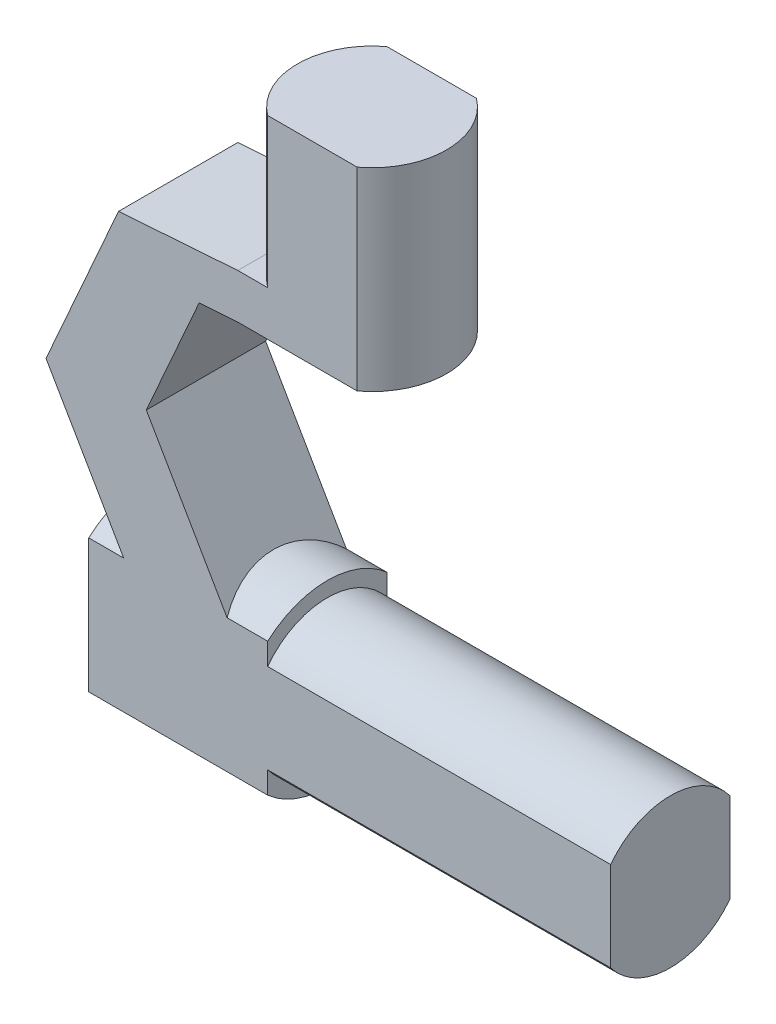
ISO-10303-21;
HEADER;
FILE_DESCRIPTION(('STEP AP214'),'2;1');
FILE_NAME('part.step','',(''),(''),'','','');
FILE_SCHEMA(('AUTOMOTIVE_DESIGN { 1 0 10303 214 1 1 1 1 }'));
ENDSEC;
DATA;
#1=APPLICATION_CONTEXT('core data for automotive mechanical design processes');
#2=APPLICATION_PROTOCOL_DEFINITION('international standard','automotive_design',2000,#1);
#3=PRODUCT_CONTEXT('',#1,'mechanical');
#4=PRODUCT('Part','Part','',(#3));
#5=PRODUCT_RELATED_PRODUCT_CATEGORY('part','',(#4));
#6=PRODUCT_DEFINITION_FORMATION('','',#4);
#7=PRODUCT_DEFINITION_CONTEXT('part definition',#1,'design');
#8=PRODUCT_DEFINITION('design','',#6,#7);
#9=PRODUCT_DEFINITION_SHAPE('','',#8);
#10=(LENGTH_UNIT() NAMED_UNIT(*) SI_UNIT(.MILLI.,.METRE.));
#11=(NAMED_UNIT(*) PLANE_ANGLE_UNIT() SI_UNIT($,.RADIAN.));
#12=(NAMED_UNIT(*) SI_UNIT($,.STERADIAN.) SOLID_ANGLE_UNIT());
#13=UNCERTAINTY_MEASURE_WITH_UNIT(LENGTH_MEASURE(1.E-05),#10,'distance_accuracy_value','');
#14=(GEOMETRIC_REPRESENTATION_CONTEXT(3) GLOBAL_UNCERTAINTY_ASSIGNED_CONTEXT((#13)) GLOBAL_UNIT_ASSIGNED_CONTEXT((#10,
#11,#12)) REPRESENTATION_CONTEXT('',''));
#15=CARTESIAN_POINT('',(0.,0.,0.));
#16=DIRECTION('',(0.,0.,1.));
#17=DIRECTION('',(1.,0.,0.));
#18=AXIS2_PLACEMENT_3D('',#15,#16,#17);
#19=CARTESIAN_POINT('',(0.,3.,0.));
#20=DIRECTION('',(0.,-1.,0.));
#21=DIRECTION('',(0.,0.,-1.));
#22=AXIS2_PLACEMENT_3D('',#19,#20,#21);
#23=CYLINDRICAL_SURFACE('',#22,5.);
#24=CARTESIAN_POINT('',(0.,13.,0.));
#25=DIRECTION('',(0.,1.,0.));
#26=DIRECTION('',(0.,0.,1.));
#27=AXIS2_PLACEMENT_3D('',#24,#25,#26);
#28=CIRCLE('',#27,5.);
#29=CARTESIAN_POINT('',(-3.00000000000001,13.,-3.99999999999999));
#30=VERTEX_POINT('',#29);
#31=CARTESIAN_POINT('',(-3.00000000000001,13.,3.99999999999999));
#32=VERTEX_POINT('',#31);
#33=EDGE_CURVE('E190',#30,#32,#28,.T.);
#34=ORIENTED_EDGE('',*,*,#33,.F.);
#35=DIRECTION('',(0.,-1.,0.));
#36=VECTOR('',#35,1.);
#37=CARTESIAN_POINT('',(-3.00000000000001,3.,-3.99999999999999));
#38=LINE('',#37,#36);
#39=CARTESIAN_POINT('',(-3.00000000000001,3.,-3.99999999999999));
#40=VERTEX_POINT('',#39);
#41=EDGE_CURVE('E54',#30,#40,#38,.T.);
#42=ORIENTED_EDGE('',*,*,#41,.T.);
#43=CARTESIAN_POINT('',(0.,3.,0.));
#44=DIRECTION('',(0.,1.,0.));
#45=DIRECTION('',(0.,0.,1.));
#46=AXIS2_PLACEMENT_3D('',#43,#44,#45);
#47=CIRCLE('',#46,5.);
#48=CARTESIAN_POINT('',(-5.,3.,0.));
#49=VERTEX_POINT('',#48);
#50=EDGE_CURVE('E197',#40,#49,#47,.T.);
#51=ORIENTED_EDGE('',*,*,#50,.T.);
#52=CARTESIAN_POINT('',(-3.,3.,3.99999999999999));
#53=VERTEX_POINT('',#52);
#54=EDGE_CURVE('E192',#49,#53,#47,.T.);
#55=ORIENTED_EDGE('',*,*,#54,.T.);
#56=DIRECTION('',(0.,-1.,0.));
#57=VECTOR('',#56,1.);
#58=CARTESIAN_POINT('',(-3.00000000000001,3.,3.99999999999999));
#59=LINE('',#58,#57);
#60=EDGE_CURVE('E179',#53,#32,#59,.F.);
#61=ORIENTED_EDGE('',*,*,#60,.T.);
#62=EDGE_LOOP('',(#34,#42,#51,#55,#61));
#63=FACE_BOUND('',#62,.T.);
#64=ADVANCED_FACE('F39',(#63),#23,.T.);
#65=CARTESIAN_POINT('',(-3.,-22.,0.));
#66=DIRECTION('',(-1.,0.,0.));
#67=DIRECTION('',(0.,0.,1.));
#68=AXIS2_PLACEMENT_3D('',#65,#66,#67);
#69=CYLINDRICAL_SURFACE('',#68,6.);
#70=DIRECTION('',(-1.,0.,0.));
#71=VECTOR('',#70,1.);
#72=CARTESIAN_POINT('',(-3.,-17.5278640450004,-3.99999999999999));
#73=LINE('',#72,#71);
#74=CARTESIAN_POINT('',(-15.,-17.5278640450004,-3.99999999999999));
#75=VERTEX_POINT('',#74);
#76=CARTESIAN_POINT('',(-12.6546913982316,-17.5278640450004,-3.99999999999999));
#77=VERTEX_POINT('',#76);
#78=EDGE_CURVE('E358',#75,#77,#73,.F.);
#79=ORIENTED_EDGE('',*,*,#78,.F.);
#80=CARTESIAN_POINT('',(-15.,-22.,0.));
#81=DIRECTION('',(-1.,0.,0.));
#82=DIRECTION('',(0.,0.,1.));
#83=AXIS2_PLACEMENT_3D('',#80,#81,#82);
#84=CIRCLE('',#83,6.);
#85=CARTESIAN_POINT('',(-15.,-17.5278640450004,3.99999999999999));
#86=VERTEX_POINT('',#85);
#87=EDGE_CURVE('E329',#86,#75,#84,.T.);
#88=ORIENTED_EDGE('',*,*,#87,.F.);
#89=DIRECTION('',(-1.,0.,0.));
#90=VECTOR('',#89,1.);
#91=CARTESIAN_POINT('',(-3.,-17.5278640450004,3.99999999999999));
#92=LINE('',#91,#90);
#93=CARTESIAN_POINT('',(-12.6546913982316,-17.5278640450004,3.99999999999999));
#94=VERTEX_POINT('',#93);
#95=EDGE_CURVE('E303',#94,#86,#92,.T.);
#96=ORIENTED_EDGE('',*,*,#95,.F.);
#97=CARTESIAN_POINT('',(-10.0638089663825,-22.,0.));
#98=DIRECTION('',(0.865279339103613,0.501290001217274,0.));
#99=DIRECTION('',(-0.501290001217274,0.865279339103613,0.));
#100=AXIS2_PLACEMENT_3D('',#97,#98,#99);
#101=ELLIPSE('',#100,6.93417689392157,6.);
#102=EDGE_CURVE('E200',#77,#94,#101,.T.);
#103=ORIENTED_EDGE('',*,*,#102,.F.);
#104=EDGE_LOOP('',(#79,#88,#96,#103));
#105=FACE_BOUND('',#104,.T.);
#106=ADVANCED_FACE('F355',(#105),#69,.T.);
#107=CARTESIAN_POINT('',(-5.72051450430999,-17.5278640450004,-3.99999999999999));
#108=VERTEX_POINT('',#107);
#109=CARTESIAN_POINT('',(-3.,-17.5278640450004,-3.99999999999999));
#110=VERTEX_POINT('',#109);
#111=EDGE_CURVE('E360',#108,#110,#73,.F.);
#112=ORIENTED_EDGE('',*,*,#111,.F.);
#113=CARTESIAN_POINT('',(-3.12963207246089,-22.,0.));
#114=DIRECTION('',(-0.865279339103613,-0.501290001217274,0.));
#115=DIRECTION('',(-0.501290001217274,0.865279339103613,0.));
#116=AXIS2_PLACEMENT_3D('',#113,#114,#115);
#117=ELLIPSE('',#116,6.93417689392157,6.);
#118=CARTESIAN_POINT('',(-5.72051450430999,-17.5278640450004,3.99999999999999));
#119=VERTEX_POINT('',#118);
#120=EDGE_CURVE('E269',#119,#108,#117,.T.);
#121=ORIENTED_EDGE('',*,*,#120,.F.);
#122=CARTESIAN_POINT('',(-3.,-17.5278640450004,3.99999999999999));
#123=VERTEX_POINT('',#122);
#124=EDGE_CURVE('E307',#123,#119,#92,.T.);
#125=ORIENTED_EDGE('',*,*,#124,.F.);
#126=CARTESIAN_POINT('',(-3.,-22.,0.));
#127=DIRECTION('',(-1.,0.,0.));
#128=DIRECTION('',(0.,0.,1.));
#129=AXIS2_PLACEMENT_3D('',#126,#127,#128);
#130=CIRCLE('',#129,6.);
#131=EDGE_CURVE('E302',#123,#110,#130,.T.);
#132=ORIENTED_EDGE('',*,*,#131,.T.);
#133=EDGE_LOOP('',(#112,#121,#125,#132));
#134=FACE_BOUND('',#133,.T.);
#135=ADVANCED_FACE('F368',(#134),#69,.T.);
#136=CARTESIAN_POINT('',(-3.,-22.,0.));
#137=DIRECTION('',(-1.,0.,0.));
#138=DIRECTION('',(0.,0.,1.));
#139=AXIS2_PLACEMENT_3D('',#136,#137,#138);
#140=PLANE('',#139);
#141=CARTESIAN_POINT('',(-3.,-26.4721359549996,-3.99999999999999));
#142=VERTEX_POINT('',#141);
#143=CARTESIAN_POINT('',(-3.,-26.4721359549996,3.99999999999999));
#144=VERTEX_POINT('',#143);
#145=EDGE_CURVE('E334',#142,#144,#130,.T.);
#146=ORIENTED_EDGE('',*,*,#145,.F.);
#147=DIRECTION('',(0.,1.,0.));
#148=VECTOR('',#147,1.);
#149=CARTESIAN_POINT('',(-3.,-22.,-3.99999999999999));
#150=LINE('',#149,#148);
#151=CARTESIAN_POINT('',(-3.,-25.,-3.99999999999999));
#152=VERTEX_POINT('',#151);
#153=EDGE_CURVE('E346',#142,#152,#150,.T.);
#154=ORIENTED_EDGE('',*,*,#153,.T.);
#155=CARTESIAN_POINT('',(-3.,-22.,0.));
#156=DIRECTION('',(-1.,0.,0.));
#157=DIRECTION('',(0.,0.,1.));
#158=AXIS2_PLACEMENT_3D('',#155,#156,#157);
#159=CIRCLE('',#158,5.);
#160=CARTESIAN_POINT('',(-3.,-25.,3.99999999999999));
#161=VERTEX_POINT('',#160);
#162=EDGE_CURVE('E265',#161,#152,#159,.F.);
#163=ORIENTED_EDGE('',*,*,#162,.F.);
#164=DIRECTION('',(0.,-1.,0.));
#165=VECTOR('',#164,1.);
#166=CARTESIAN_POINT('',(-3.,-22.,3.99999999999999));
#167=LINE('',#166,#165);
#168=EDGE_CURVE('E306',#161,#144,#167,.T.);
#169=ORIENTED_EDGE('',*,*,#168,.T.);
#170=EDGE_LOOP('',(#146,#154,#163,#169));
#171=FACE_BOUND('',#170,.T.);
#172=ADVANCED_FACE('F345',(#171),#140,.F.);
#173=CARTESIAN_POINT('',(-15.,-22.,0.));
#174=DIRECTION('',(1.,0.,0.));
#175=DIRECTION('',(0.,0.,-1.));
#176=AXIS2_PLACEMENT_3D('',#173,#174,#175);
#177=CYLINDRICAL_SURFACE('',#176,5.);
#178=DIRECTION('',(1.,0.,0.));
#179=VECTOR('',#178,1.);
#180=CARTESIAN_POINT('',(-15.,-25.,-3.99999999999999));
#181=LINE('',#180,#179);
#182=CARTESIAN_POINT('',(20.,-25.,-4.));
#183=VERTEX_POINT('',#182);
#184=EDGE_CURVE('E11',#183,#152,#181,.F.);
#185=ORIENTED_EDGE('',*,*,#184,.F.);
#186=CARTESIAN_POINT('',(20.,-22.,0.));
#187=DIRECTION('',(1.,0.,0.));
#188=DIRECTION('',(0.,0.,-1.));
#189=AXIS2_PLACEMENT_3D('',#186,#187,#188);
#190=CIRCLE('',#189,5.);
#191=CARTESIAN_POINT('',(20.,-25.,3.99999999999999));
#192=VERTEX_POINT('',#191);
#193=EDGE_CURVE('E199',#192,#183,#190,.T.);
#194=ORIENTED_EDGE('',*,*,#193,.F.);
#195=DIRECTION('',(1.,0.,0.));
#196=VECTOR('',#195,1.);
#197=CARTESIAN_POINT('',(-15.,-25.,3.99999999999999));
#198=LINE('',#197,#196);
#199=EDGE_CURVE('E272',#161,#192,#198,.T.);
#200=ORIENTED_EDGE('',*,*,#199,.F.);
#201=ORIENTED_EDGE('',*,*,#162,.T.);
#202=EDGE_LOOP('',(#185,#194,#200,#201));
#203=FACE_BOUND('',#202,.T.);
#204=ADVANCED_FACE('F351',(#203),#177,.T.);
#205=CARTESIAN_POINT('',(0.,3.,0.));
#206=DIRECTION('',(0.,1.,0.));
#207=DIRECTION('',(0.,0.,1.));
#208=AXIS2_PLACEMENT_3D('',#205,#206,#207);
#209=PLANE('',#208);
#210=ORIENTED_EDGE('',*,*,#50,.F.);
#211=DIRECTION('',(-1.,0.,0.));
#212=VECTOR('',#211,1.);
#213=CARTESIAN_POINT('',(0.,3.,-4.));
#214=LINE('',#213,#212);
#215=CARTESIAN_POINT('',(-5.,3.,-4.));
#216=VERTEX_POINT('',#215);
#217=EDGE_CURVE('E208',#40,#216,#214,.T.);
#218=ORIENTED_EDGE('',*,*,#217,.T.);
#219=DIRECTION('',(0.,0.,-1.));
#220=VECTOR('',#219,1.);
#221=CARTESIAN_POINT('',(-5.,3.,4.));
#222=LINE('',#221,#220);
#223=EDGE_CURVE('E258',#49,#216,#222,.T.);
#224=ORIENTED_EDGE('',*,*,#223,.F.);
#225=EDGE_LOOP('',(#210,#218,#224));
#226=FACE_BOUND('',#225,.T.);
#227=ADVANCED_FACE('F400',(#226),#209,.T.);
#228=CARTESIAN_POINT('',(0.,0.,0.));
#229=DIRECTION('',(0.,1.,0.));
#230=DIRECTION('',(0.,0.,1.));
#231=AXIS2_PLACEMENT_3D('',#228,#229,#230);
#232=CIRCLE('',#231,5.);
#233=CARTESIAN_POINT('',(3.00000000000001,0.,4.));
#234=VERTEX_POINT('',#233);
#235=CARTESIAN_POINT('',(3.00000000000001,0.,-4.));
#236=VERTEX_POINT('',#235);
#237=EDGE_CURVE('E262',#234,#236,#232,.T.);
#238=ORIENTED_EDGE('',*,*,#237,.T.);
#239=DIRECTION('',(0.,-1.,0.));
#240=VECTOR('',#239,1.);
#241=CARTESIAN_POINT('',(3.00000000000001,3.,-3.99999999999999));
#242=LINE('',#241,#240);
#243=CARTESIAN_POINT('',(3.00000000000001,13.,-4.));
#244=VERTEX_POINT('',#243);
#245=EDGE_CURVE('E323',#236,#244,#242,.F.);
#246=ORIENTED_EDGE('',*,*,#245,.T.);
#247=CARTESIAN_POINT('',(3.00000000000001,13.,4.));
#248=VERTEX_POINT('',#247);
#249=EDGE_CURVE('E196',#248,#244,#28,.T.);
#250=ORIENTED_EDGE('',*,*,#249,.F.);
#251=DIRECTION('',(0.,-1.,0.));
#252=VECTOR('',#251,1.);
#253=CARTESIAN_POINT('',(3.00000000000001,3.,3.99999999999999));
#254=LINE('',#253,#252);
#255=EDGE_CURVE('E62',#248,#234,#254,.T.);
#256=ORIENTED_EDGE('',*,*,#255,.T.);
#257=EDGE_LOOP('',(#238,#246,#250,#256));
#258=FACE_BOUND('',#257,.T.);
#259=ADVANCED_FACE('F41',(#258),#23,.T.);
#260=ORIENTED_EDGE('',*,*,#54,.F.);
#261=CARTESIAN_POINT('',(-5.,3.,4.));
#262=VERTEX_POINT('',#261);
#263=EDGE_CURVE('E259',#262,#49,#222,.T.);
#264=ORIENTED_EDGE('',*,*,#263,.F.);
#265=DIRECTION('',(-1.,0.,0.));
#266=VECTOR('',#265,1.);
#267=CARTESIAN_POINT('',(0.,3.,4.));
#268=LINE('',#267,#266);
#269=EDGE_CURVE('E209',#53,#262,#268,.T.);
#270=ORIENTED_EDGE('',*,*,#269,.F.);
#271=EDGE_LOOP('',(#260,#264,#270));
#272=FACE_BOUND('',#271,.T.);
#273=ADVANCED_FACE('F399',(#272),#209,.T.);
#274=CARTESIAN_POINT('',(0.,0.,0.));
#275=DIRECTION('',(0.,1.,0.));
#276=DIRECTION('',(0.,0.,1.));
#277=AXIS2_PLACEMENT_3D('',#274,#275,#276);
#278=PLANE('',#277);
#279=DIRECTION('',(1.,0.,0.));
#280=VECTOR('',#279,1.);
#281=CARTESIAN_POINT('',(-5.,0.,-4.));
#282=LINE('',#281,#280);
#283=CARTESIAN_POINT('',(-5.,0.,-4.));
#284=VERTEX_POINT('',#283);
#285=EDGE_CURVE('E212',#284,#236,#282,.T.);
#286=ORIENTED_EDGE('',*,*,#285,.T.);
#287=ORIENTED_EDGE('',*,*,#237,.F.);
#288=DIRECTION('',(1.,0.,0.));
#289=VECTOR('',#288,1.);
#290=CARTESIAN_POINT('',(-5.,0.,4.));
#291=LINE('',#290,#289);
#292=CARTESIAN_POINT('',(-5.,0.,4.));
#293=VERTEX_POINT('',#292);
#294=EDGE_CURVE('E225',#293,#234,#291,.T.);
#295=ORIENTED_EDGE('',*,*,#294,.F.);
#296=DIRECTION('',(0.,0.,-1.));
#297=VECTOR('',#296,1.);
#298=CARTESIAN_POINT('',(-5.,0.,4.));
#299=LINE('',#298,#297);
#300=EDGE_CURVE('E227',#293,#284,#299,.T.);
#301=ORIENTED_EDGE('',*,*,#300,.T.);
#302=EDGE_LOOP('',(#286,#287,#295,#301));
#303=FACE_BOUND('',#302,.T.);
#304=ADVANCED_FACE('F380',(#303),#278,.F.);
#305=CARTESIAN_POINT('',(0.,0.,4.));
#306=DIRECTION('',(0.,0.,-1.));
#307=DIRECTION('',(-1.,0.,0.));
#308=AXIS2_PLACEMENT_3D('',#305,#306,#307);
#309=PLANE('',#308);
#310=DIRECTION('',(0.501290001217274,-0.865279339103613,0.));
#311=VECTOR('',#310,1.);
#312=CARTESIAN_POINT('',(-17.8631990408828,-8.53743128191803,4.));
#313=LINE('',#312,#311);
#314=CARTESIAN_POINT('',(-17.8631990408828,-8.53743128191803,4.));
#315=VERTEX_POINT('',#314);
#316=EDGE_CURVE('E216',#315,#94,#313,.T.);
#317=ORIENTED_EDGE('',*,*,#316,.T.);
#318=ORIENTED_EDGE('',*,*,#95,.T.);
#319=DIRECTION('',(0.,1.,0.));
#320=VECTOR('',#319,1.);
#321=CARTESIAN_POINT('',(-15.,-22.,3.99999999999999));
#322=LINE('',#321,#320);
#323=CARTESIAN_POINT('',(-15.,-26.4721359549996,3.99999999999999));
#324=VERTEX_POINT('',#323);
#325=EDGE_CURVE('E304',#324,#86,#322,.T.);
#326=ORIENTED_EDGE('',*,*,#325,.F.);
#327=DIRECTION('',(-1.,0.,0.));
#328=VECTOR('',#327,1.);
#329=CARTESIAN_POINT('',(-3.,-26.4721359549996,3.99999999999999));
#330=LINE('',#329,#328);
#331=EDGE_CURVE('E310',#324,#144,#330,.F.);
#332=ORIENTED_EDGE('',*,*,#331,.T.);
#333=ORIENTED_EDGE('',*,*,#168,.F.);
#334=ORIENTED_EDGE('',*,*,#199,.T.);
#335=DIRECTION('',(0.,1.,0.));
#336=VECTOR('',#335,1.);
#337=CARTESIAN_POINT('',(20.,-22.,4.));
#338=LINE('',#337,#336);
#339=CARTESIAN_POINT('',(20.,-19.,4.));
#340=VERTEX_POINT('',#339);
#341=EDGE_CURVE('E297',#192,#340,#338,.T.);
#342=ORIENTED_EDGE('',*,*,#341,.T.);
#343=DIRECTION('',(1.,0.,0.));
#344=VECTOR('',#343,1.);
#345=CARTESIAN_POINT('',(-15.,-19.,3.99999999999999));
#346=LINE('',#345,#344);
#347=CARTESIAN_POINT('',(-3.,-19.,3.99999999999999));
#348=VERTEX_POINT('',#347);
#349=EDGE_CURVE('E274',#340,#348,#346,.F.);
#350=ORIENTED_EDGE('',*,*,#349,.T.);
#351=EDGE_CURVE('E295',#123,#348,#167,.T.);
#352=ORIENTED_EDGE('',*,*,#351,.F.);
#353=ORIENTED_EDGE('',*,*,#124,.T.);
#354=DIRECTION('',(-0.501290001217274,0.865279339103613,0.));
#355=VECTOR('',#354,1.);
#356=CARTESIAN_POINT('',(-1.39161530066352,-25.,4.));
#357=LINE('',#356,#355);
#358=CARTESIAN_POINT('',(-11.1392271957222,-8.17459522848294,4.));
#359=VERTEX_POINT('',#358);
#360=EDGE_CURVE('E218',#119,#359,#357,.T.);
#361=ORIENTED_EDGE('',*,*,#360,.T.);
#362=DIRECTION('',(0.405266586740234,0.914198552652497,0.));
#363=VECTOR('',#362,1.);
#364=CARTESIAN_POINT('',(-11.1392271957222,-8.17459522848294,4.));
#365=LINE('',#364,#363);
#366=CARTESIAN_POINT('',(-7.5970106159308,-0.184078920503494,4.));
#367=VERTEX_POINT('',#366);
#368=EDGE_CURVE('E220',#359,#367,#365,.T.);
#369=ORIENTED_EDGE('',*,*,#368,.T.);
#370=DIRECTION('',(0.997497362399454,0.0707036916018776,0.));
#371=VECTOR('',#370,1.);
#372=CARTESIAN_POINT('',(-7.5970106159308,-0.184078920503494,4.));
#373=LINE('',#372,#371);
#374=EDGE_CURVE('E222',#367,#293,#373,.T.);
#375=ORIENTED_EDGE('',*,*,#374,.T.);
#376=ORIENTED_EDGE('',*,*,#294,.T.);
#377=ORIENTED_EDGE('',*,*,#255,.F.);
#378=DIRECTION('',(-1.,0.,0.));
#379=VECTOR('',#378,1.);
#380=CARTESIAN_POINT('',(-33.,13.,3.99999999999999));
#381=LINE('',#380,#379);
#382=EDGE_CURVE('E175',#248,#32,#381,.T.);
#383=ORIENTED_EDGE('',*,*,#382,.T.);
#384=ORIENTED_EDGE('',*,*,#60,.F.);
#385=ORIENTED_EDGE('',*,*,#269,.T.);
#386=DIRECTION('',(-0.997497362399454,-0.0707036916018774,0.));
#387=VECTOR('',#386,1.);
#388=CARTESIAN_POINT('',(-5.,3.,4.));
#389=LINE('',#388,#387);
#390=CARTESIAN_POINT('',(-13.,2.43295134991193,4.));
#391=VERTEX_POINT('',#390);
#392=EDGE_CURVE('E211',#262,#391,#389,.T.);
#393=ORIENTED_EDGE('',*,*,#392,.T.);
#394=DIRECTION('',(-0.405266586740234,-0.914198552652497,0.));
#395=VECTOR('',#394,1.);
#396=CARTESIAN_POINT('',(-13.,2.43295134991193,4.));
#397=LINE('',#396,#395);
#398=EDGE_CURVE('E214',#391,#315,#397,.T.);
#399=ORIENTED_EDGE('',*,*,#398,.T.);
#400=EDGE_LOOP('',(#317,#318,#326,#332,#333,#334,#342,#350,#352,#353,#361,#369,#375,#376,#377,
#383,#384,#385,#393,#399));
#401=FACE_BOUND('',#400,.T.);
#402=ADVANCED_FACE('F178',(#401),#309,.F.);
#403=CARTESIAN_POINT('',(0.,0.,-4.));
#404=DIRECTION('',(0.,0.,-1.));
#405=DIRECTION('',(-1.,0.,0.));
#406=AXIS2_PLACEMENT_3D('',#403,#404,#405);
#407=PLANE('',#406);
#408=DIRECTION('',(-0.501290001217274,0.865279339103613,0.));
#409=VECTOR('',#408,1.);
#410=CARTESIAN_POINT('',(-1.39161530066352,-25.,-4.));
#411=LINE('',#410,#409);
#412=CARTESIAN_POINT('',(-11.1392271957222,-8.17459522848294,-4.));
#413=VERTEX_POINT('',#412);
#414=EDGE_CURVE('E237',#108,#413,#411,.T.);
#415=ORIENTED_EDGE('',*,*,#414,.F.);
#416=ORIENTED_EDGE('',*,*,#111,.T.);
#417=CARTESIAN_POINT('',(-3.,-19.,-3.99999999999999));
#418=VERTEX_POINT('',#417);
#419=EDGE_CURVE('E281',#418,#110,#150,.T.);
#420=ORIENTED_EDGE('',*,*,#419,.F.);
#421=DIRECTION('',(1.,0.,0.));
#422=VECTOR('',#421,1.);
#423=CARTESIAN_POINT('',(-15.,-19.,-3.99999999999999));
#424=LINE('',#423,#422);
#425=CARTESIAN_POINT('',(20.,-19.,-3.99999999999999));
#426=VERTEX_POINT('',#425);
#427=EDGE_CURVE('E47',#418,#426,#424,.T.);
#428=ORIENTED_EDGE('',*,*,#427,.T.);
#429=DIRECTION('',(0.,-1.,0.));
#430=VECTOR('',#429,1.);
#431=CARTESIAN_POINT('',(20.,-22.,-4.));
#432=LINE('',#431,#430);
#433=EDGE_CURVE('E193',#426,#183,#432,.T.);
#434=ORIENTED_EDGE('',*,*,#433,.T.);
#435=ORIENTED_EDGE('',*,*,#184,.T.);
#436=ORIENTED_EDGE('',*,*,#153,.F.);
#437=DIRECTION('',(-1.,0.,0.));
#438=VECTOR('',#437,1.);
#439=CARTESIAN_POINT('',(-3.,-26.4721359549996,-3.99999999999999));
#440=LINE('',#439,#438);
#441=CARTESIAN_POINT('',(-15.,-26.4721359549996,-3.99999999999999));
#442=VERTEX_POINT('',#441);
#443=EDGE_CURVE('E330',#142,#442,#440,.T.);
#444=ORIENTED_EDGE('',*,*,#443,.T.);
#445=DIRECTION('',(0.,-1.,0.));
#446=VECTOR('',#445,1.);
#447=CARTESIAN_POINT('',(-15.,-22.,-3.99999999999999));
#448=LINE('',#447,#446);
#449=EDGE_CURVE('E347',#75,#442,#448,.T.);
#450=ORIENTED_EDGE('',*,*,#449,.F.);
#451=ORIENTED_EDGE('',*,*,#78,.T.);
#452=DIRECTION('',(0.501290001217274,-0.865279339103613,0.));
#453=VECTOR('',#452,1.);
#454=CARTESIAN_POINT('',(-17.8631990408828,-8.53743128191803,-4.));
#455=LINE('',#454,#453);
#456=CARTESIAN_POINT('',(-17.8631990408828,-8.53743128191803,-4.));
#457=VERTEX_POINT('',#456);
#458=EDGE_CURVE('E234',#457,#77,#455,.T.);
#459=ORIENTED_EDGE('',*,*,#458,.F.);
#460=DIRECTION('',(-0.405266586740234,-0.914198552652497,0.));
#461=VECTOR('',#460,1.);
#462=CARTESIAN_POINT('',(-13.,2.43295134991193,-4.));
#463=LINE('',#462,#461);
#464=CARTESIAN_POINT('',(-13.,2.43295134991193,-4.));
#465=VERTEX_POINT('',#464);
#466=EDGE_CURVE('E232',#465,#457,#463,.T.);
#467=ORIENTED_EDGE('',*,*,#466,.F.);
#468=DIRECTION('',(-0.997497362399454,-0.0707036916018774,0.));
#469=VECTOR('',#468,1.);
#470=CARTESIAN_POINT('',(-5.,3.,-4.));
#471=LINE('',#470,#469);
#472=EDGE_CURVE('E230',#216,#465,#471,.T.);
#473=ORIENTED_EDGE('',*,*,#472,.F.);
#474=ORIENTED_EDGE('',*,*,#217,.F.);
#475=ORIENTED_EDGE('',*,*,#41,.F.);
#476=DIRECTION('',(1.,0.,0.));
#477=VECTOR('',#476,1.);
#478=CARTESIAN_POINT('',(-33.,13.,-3.99999999999999));
#479=LINE('',#478,#477);
#480=EDGE_CURVE('E185',#30,#244,#479,.T.);
#481=ORIENTED_EDGE('',*,*,#480,.T.);
#482=ORIENTED_EDGE('',*,*,#245,.F.);
#483=ORIENTED_EDGE('',*,*,#285,.F.);
#484=DIRECTION('',(0.997497362399454,0.0707036916018776,0.));
#485=VECTOR('',#484,1.);
#486=CARTESIAN_POINT('',(-7.5970106159308,-0.184078920503494,-4.));
#487=LINE('',#486,#485);
#488=CARTESIAN_POINT('',(-7.5970106159308,-0.184078920503494,-4.));
#489=VERTEX_POINT('',#488);
#490=EDGE_CURVE('E241',#489,#284,#487,.T.);
#491=ORIENTED_EDGE('',*,*,#490,.F.);
#492=DIRECTION('',(0.405266586740234,0.914198552652497,0.));
#493=VECTOR('',#492,1.);
#494=CARTESIAN_POINT('',(-11.1392271957222,-8.17459522848294,-4.));
#495=LINE('',#494,#493);
#496=EDGE_CURVE('E239',#413,#489,#495,.T.);
#497=ORIENTED_EDGE('',*,*,#496,.F.);
#498=EDGE_LOOP('',(#415,#416,#420,#428,#434,#435,#436,#444,#450,#451,#459,#467,#473,#474,#475,
#481,#482,#483,#491,#497));
#499=FACE_BOUND('',#498,.T.);
#500=ADVANCED_FACE('F278',(#499),#407,.T.);
#501=CARTESIAN_POINT('',(-5.,3.,4.));
#502=DIRECTION('',(0.0707036916018774,-0.997497362399454,0.));
#503=DIRECTION('',(0.997497362399454,0.0707036916018774,0.));
#504=AXIS2_PLACEMENT_3D('',#501,#502,#503);
#505=PLANE('',#504);
#506=ORIENTED_EDGE('',*,*,#472,.T.);
#507=DIRECTION('',(0.,0.,-1.));
#508=VECTOR('',#507,1.);
#509=CARTESIAN_POINT('',(-13.,2.43295134991193,4.));
#510=LINE('',#509,#508);
#511=EDGE_CURVE('E255',#391,#465,#510,.T.);
#512=ORIENTED_EDGE('',*,*,#511,.F.);
#513=ORIENTED_EDGE('',*,*,#392,.F.);
#514=ORIENTED_EDGE('',*,*,#263,.T.);
#515=ORIENTED_EDGE('',*,*,#223,.T.);
#516=EDGE_LOOP('',(#506,#512,#513,#514,#515));
#517=FACE_BOUND('',#516,.T.);
#518=ADVANCED_FACE('F414',(#517),#505,.F.);
#519=CARTESIAN_POINT('',(-13.,2.43295134991193,4.));
#520=DIRECTION('',(0.914198552652497,-0.405266586740234,0.));
#521=DIRECTION('',(0.405266586740234,0.914198552652497,0.));
#522=AXIS2_PLACEMENT_3D('',#519,#520,#521);
#523=PLANE('',#522);
#524=ORIENTED_EDGE('',*,*,#466,.T.);
#525=DIRECTION('',(0.,0.,-1.));
#526=VECTOR('',#525,1.);
#527=CARTESIAN_POINT('',(-17.8631990408828,-8.53743128191803,4.));
#528=LINE('',#527,#526);
#529=EDGE_CURVE('E252',#315,#457,#528,.T.);
#530=ORIENTED_EDGE('',*,*,#529,.F.);
#531=ORIENTED_EDGE('',*,*,#398,.F.);
#532=ORIENTED_EDGE('',*,*,#511,.T.);
#533=EDGE_LOOP('',(#524,#530,#531,#532));
#534=FACE_BOUND('',#533,.T.);
#535=ADVANCED_FACE('F478',(#534),#523,.F.);
#536=CARTESIAN_POINT('',(-17.8631990408828,-8.53743128191803,4.));
#537=DIRECTION('',(0.865279339103613,0.501290001217274,0.));
#538=DIRECTION('',(-0.501290001217274,0.865279339103613,0.));
#539=AXIS2_PLACEMENT_3D('',#536,#537,#538);
#540=PLANE('',#539);
#541=ORIENTED_EDGE('',*,*,#458,.T.);
#542=ORIENTED_EDGE('',*,*,#102,.T.);
#543=ORIENTED_EDGE('',*,*,#316,.F.);
#544=ORIENTED_EDGE('',*,*,#529,.T.);
#545=EDGE_LOOP('',(#541,#542,#543,#544));
#546=FACE_BOUND('',#545,.T.);
#547=ADVANCED_FACE('F474',(#546),#540,.F.);
#548=CARTESIAN_POINT('',(-1.39161530066352,-25.,4.));
#549=DIRECTION('',(-0.865279339103613,-0.501290001217274,0.));
#550=DIRECTION('',(0.501290001217274,-0.865279339103613,0.));
#551=AXIS2_PLACEMENT_3D('',#548,#549,#550);
#552=PLANE('',#551);
#553=ORIENTED_EDGE('',*,*,#360,.F.);
#554=ORIENTED_EDGE('',*,*,#120,.T.);
#555=ORIENTED_EDGE('',*,*,#414,.T.);
#556=DIRECTION('',(0.,0.,-1.));
#557=VECTOR('',#556,1.);
#558=CARTESIAN_POINT('',(-11.1392271957222,-8.17459522848294,4.));
#559=LINE('',#558,#557);
#560=EDGE_CURVE('E249',#359,#413,#559,.T.);
#561=ORIENTED_EDGE('',*,*,#560,.F.);
#562=EDGE_LOOP('',(#553,#554,#555,#561));
#563=FACE_BOUND('',#562,.T.);
#564=ADVANCED_FACE('F370',(#563),#552,.F.);
#565=CARTESIAN_POINT('',(-11.1392271957222,-8.17459522848294,4.));
#566=DIRECTION('',(-0.914198552652497,0.405266586740234,0.));
#567=DIRECTION('',(-0.405266586740234,-0.914198552652497,0.));
#568=AXIS2_PLACEMENT_3D('',#565,#566,#567);
#569=PLANE('',#568);
#570=ORIENTED_EDGE('',*,*,#496,.T.);
#571=DIRECTION('',(0.,0.,-1.));
#572=VECTOR('',#571,1.);
#573=CARTESIAN_POINT('',(-7.5970106159308,-0.184078920503494,4.));
#574=LINE('',#573,#572);
#575=EDGE_CURVE('E246',#367,#489,#574,.T.);
#576=ORIENTED_EDGE('',*,*,#575,.F.);
#577=ORIENTED_EDGE('',*,*,#368,.F.);
#578=ORIENTED_EDGE('',*,*,#560,.T.);
#579=EDGE_LOOP('',(#570,#576,#577,#578));
#580=FACE_BOUND('',#579,.T.);
#581=ADVANCED_FACE('F375',(#580),#569,.F.);
#582=CARTESIAN_POINT('',(-7.5970106159308,-0.184078920503494,4.));
#583=DIRECTION('',(-0.0707036916018776,0.997497362399454,0.));
#584=DIRECTION('',(-0.997497362399454,-0.0707036916018776,0.));
#585=AXIS2_PLACEMENT_3D('',#582,#583,#584);
#586=PLANE('',#585);
#587=ORIENTED_EDGE('',*,*,#490,.T.);
#588=ORIENTED_EDGE('',*,*,#300,.F.);
#589=ORIENTED_EDGE('',*,*,#374,.F.);
#590=ORIENTED_EDGE('',*,*,#575,.T.);
#591=EDGE_LOOP('',(#587,#588,#589,#590));
#592=FACE_BOUND('',#591,.T.);
#593=ADVANCED_FACE('F382',(#592),#586,.F.);
#594=CARTESIAN_POINT('',(0.,13.,0.));
#595=DIRECTION('',(0.,1.,0.));
#596=DIRECTION('',(0.,0.,1.));
#597=AXIS2_PLACEMENT_3D('',#594,#595,#596);
#598=PLANE('',#597);
#599=ORIENTED_EDGE('',*,*,#480,.F.);
#600=ORIENTED_EDGE('',*,*,#33,.T.);
#601=ORIENTED_EDGE('',*,*,#382,.F.);
#602=ORIENTED_EDGE('',*,*,#249,.T.);
#603=EDGE_LOOP('',(#599,#600,#601,#602));
#604=FACE_BOUND('',#603,.T.);
#605=ADVANCED_FACE('F195',(#604),#598,.T.);
#606=ORIENTED_EDGE('',*,*,#443,.F.);
#607=ORIENTED_EDGE('',*,*,#145,.T.);
#608=ORIENTED_EDGE('',*,*,#331,.F.);
#609=EDGE_CURVE('E326',#442,#324,#84,.T.);
#610=ORIENTED_EDGE('',*,*,#609,.F.);
#611=EDGE_LOOP('',(#606,#607,#608,#610));
#612=FACE_BOUND('',#611,.T.);
#613=ADVANCED_FACE('F342',(#612),#69,.T.);
#614=EDGE_CURVE('E268',#418,#348,#159,.F.);
#615=ORIENTED_EDGE('',*,*,#614,.F.);
#616=ORIENTED_EDGE('',*,*,#419,.T.);
#617=ORIENTED_EDGE('',*,*,#131,.F.);
#618=ORIENTED_EDGE('',*,*,#351,.T.);
#619=EDGE_LOOP('',(#615,#616,#617,#618));
#620=FACE_BOUND('',#619,.T.);
#621=ADVANCED_FACE('F300',(#620),#140,.F.);
#622=CARTESIAN_POINT('',(-15.,-22.,0.));
#623=DIRECTION('',(1.,0.,0.));
#624=DIRECTION('',(0.,0.,-1.));
#625=AXIS2_PLACEMENT_3D('',#622,#623,#624);
#626=PLANE('',#625);
#627=ORIENTED_EDGE('',*,*,#87,.T.);
#628=ORIENTED_EDGE('',*,*,#449,.T.);
#629=ORIENTED_EDGE('',*,*,#609,.T.);
#630=ORIENTED_EDGE('',*,*,#325,.T.);
#631=EDGE_LOOP('',(#627,#628,#629,#630));
#632=FACE_BOUND('',#631,.T.);
#633=ADVANCED_FACE('F352',(#632),#626,.F.);
#634=CARTESIAN_POINT('',(20.,-22.,0.));
#635=DIRECTION('',(1.,0.,0.));
#636=DIRECTION('',(0.,0.,-1.));
#637=AXIS2_PLACEMENT_3D('',#634,#635,#636);
#638=PLANE('',#637);
#639=ORIENTED_EDGE('',*,*,#433,.F.);
#640=EDGE_CURVE('E205',#426,#340,#190,.T.);
#641=ORIENTED_EDGE('',*,*,#640,.T.);
#642=ORIENTED_EDGE('',*,*,#341,.F.);
#643=ORIENTED_EDGE('',*,*,#193,.T.);
#644=EDGE_LOOP('',(#639,#641,#642,#643));
#645=FACE_BOUND('',#644,.T.);
#646=ADVANCED_FACE('F288',(#645),#638,.T.);
#647=ORIENTED_EDGE('',*,*,#427,.F.);
#648=ORIENTED_EDGE('',*,*,#614,.T.);
#649=ORIENTED_EDGE('',*,*,#349,.F.);
#650=ORIENTED_EDGE('',*,*,#640,.F.);
#651=EDGE_LOOP('',(#647,#648,#649,#650));
#652=FACE_BOUND('',#651,.T.);
#653=ADVANCED_FACE('F293',(#652),#177,.T.);
#654=CLOSED_SHELL('',(#64,#106,#135,#172,#204,#227,#259,#273,#304,#402,#500,#518,#535,#547,#564,
#581,#593,#605,#613,#621,#633,#646,#653));
#655=MANIFOLD_SOLID_BREP('B2',#654);
#656=ADVANCED_BREP_SHAPE_REPRESENTATION('',(#18,#655),#14);
#657=SHAPE_DEFINITION_REPRESENTATION(#9,#656);
ENDSEC;
END-ISO-10303-21;
